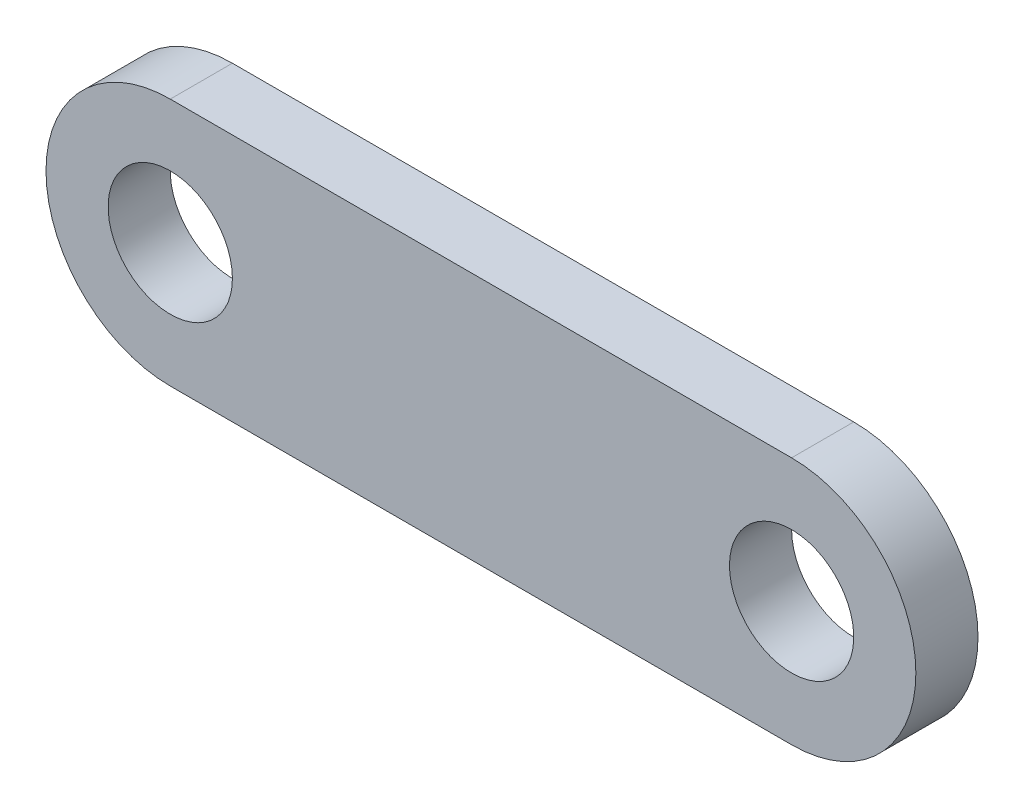
ISO-10303-21;
HEADER;
FILE_DESCRIPTION(('STEP AP214'),'2;1');
FILE_NAME('part.step','',(''),(''),'','','');
FILE_SCHEMA(('AUTOMOTIVE_DESIGN { 1 0 10303 214 1 1 1 1 }'));
ENDSEC;
DATA;
#1=APPLICATION_CONTEXT('core data for automotive mechanical design processes');
#2=APPLICATION_PROTOCOL_DEFINITION('international standard','automotive_design',2000,#1);
#3=PRODUCT_CONTEXT('',#1,'mechanical');
#4=PRODUCT('Part','Part','',(#3));
#5=PRODUCT_RELATED_PRODUCT_CATEGORY('part','',(#4));
#6=PRODUCT_DEFINITION_FORMATION('','',#4);
#7=PRODUCT_DEFINITION_CONTEXT('part definition',#1,'design');
#8=PRODUCT_DEFINITION('design','',#6,#7);
#9=PRODUCT_DEFINITION_SHAPE('','',#8);
#10=(LENGTH_UNIT() NAMED_UNIT(*) SI_UNIT(.MILLI.,.METRE.));
#11=(NAMED_UNIT(*) PLANE_ANGLE_UNIT() SI_UNIT($,.RADIAN.));
#12=(NAMED_UNIT(*) SI_UNIT($,.STERADIAN.) SOLID_ANGLE_UNIT());
#13=UNCERTAINTY_MEASURE_WITH_UNIT(LENGTH_MEASURE(1.E-05),#10,'distance_accuracy_value','');
#14=(GEOMETRIC_REPRESENTATION_CONTEXT(3) GLOBAL_UNCERTAINTY_ASSIGNED_CONTEXT((#13)) GLOBAL_UNIT_ASSIGNED_CONTEXT((#10,
#11,#12)) REPRESENTATION_CONTEXT('',''));
#15=CARTESIAN_POINT('',(0.,0.,0.));
#16=DIRECTION('',(0.,0.,1.));
#17=DIRECTION('',(1.,0.,0.));
#18=AXIS2_PLACEMENT_3D('',#15,#16,#17);
#19=CARTESIAN_POINT('',(0.,0.,2.));
#20=DIRECTION('',(0.,0.,1.));
#21=DIRECTION('',(1.,0.,0.));
#22=AXIS2_PLACEMENT_3D('',#19,#20,#21);
#23=PLANE('',#22);
#24=CARTESIAN_POINT('',(0.,0.,2.));
#25=DIRECTION('',(0.,0.,1.));
#26=DIRECTION('',(1.,0.,0.));
#27=AXIS2_PLACEMENT_3D('',#24,#25,#26);
#28=CIRCLE('',#27,2.);
#29=CARTESIAN_POINT('',(2.,0.,2.));
#30=VERTEX_POINT('',#29);
#31=EDGE_CURVE('E101',#30,#30,#28,.T.);
#32=ORIENTED_EDGE('',*,*,#31,.F.);
#33=EDGE_LOOP('',(#32));
#34=FACE_BOUND('',#33,.T.);
#35=CARTESIAN_POINT('',(0.,0.,2.));
#36=DIRECTION('',(0.,0.,1.));
#37=DIRECTION('',(1.,0.,0.));
#38=AXIS2_PLACEMENT_3D('',#35,#36,#37);
#39=CIRCLE('',#38,4.);
#40=CARTESIAN_POINT('',(0.,4.,2.));
#41=VERTEX_POINT('',#40);
#42=CARTESIAN_POINT('',(0.,-4.,2.));
#43=VERTEX_POINT('',#42);
#44=EDGE_CURVE('E86',#41,#43,#39,.T.);
#45=ORIENTED_EDGE('',*,*,#44,.T.);
#46=DIRECTION('',(1.,0.,0.));
#47=VECTOR('',#46,1.);
#48=CARTESIAN_POINT('',(0.,-4.,2.));
#49=LINE('',#48,#47);
#50=CARTESIAN_POINT('',(20.,-4.,2.));
#51=VERTEX_POINT('',#50);
#52=EDGE_CURVE('E81',#43,#51,#49,.T.);
#53=ORIENTED_EDGE('',*,*,#52,.T.);
#54=CARTESIAN_POINT('',(20.,0.,2.));
#55=DIRECTION('',(0.,0.,1.));
#56=DIRECTION('',(1.,0.,0.));
#57=AXIS2_PLACEMENT_3D('',#54,#55,#56);
#58=CIRCLE('',#57,4.);
#59=CARTESIAN_POINT('',(20.,4.,2.));
#60=VERTEX_POINT('',#59);
#61=EDGE_CURVE('E84',#51,#60,#58,.T.);
#62=ORIENTED_EDGE('',*,*,#61,.T.);
#63=DIRECTION('',(-1.,0.,0.));
#64=VECTOR('',#63,1.);
#65=CARTESIAN_POINT('',(0.,4.,2.));
#66=LINE('',#65,#64);
#67=EDGE_CURVE('E51',#60,#41,#66,.T.);
#68=ORIENTED_EDGE('',*,*,#67,.T.);
#69=EDGE_LOOP('',(#45,#53,#62,#68));
#70=FACE_BOUND('',#69,.T.);
#71=CARTESIAN_POINT('',(20.,0.,2.));
#72=DIRECTION('',(0.,0.,1.));
#73=DIRECTION('',(-1.,0.,0.));
#74=AXIS2_PLACEMENT_3D('',#71,#72,#73);
#75=CIRCLE('',#74,2.);
#76=CARTESIAN_POINT('',(18.,0.,2.));
#77=VERTEX_POINT('',#76);
#78=EDGE_CURVE('E116',#77,#77,#75,.T.);
#79=ORIENTED_EDGE('',*,*,#78,.F.);
#80=EDGE_LOOP('',(#79));
#81=FACE_BOUND('',#80,.T.);
#82=ADVANCED_FACE('F34',(#34,#70,#81),#23,.T.);
#83=CARTESIAN_POINT('',(0.,0.,0.));
#84=DIRECTION('',(0.,0.,1.));
#85=DIRECTION('',(1.,0.,0.));
#86=AXIS2_PLACEMENT_3D('',#83,#84,#85);
#87=PLANE('',#86);
#88=CARTESIAN_POINT('',(0.,0.,0.));
#89=DIRECTION('',(0.,0.,1.));
#90=DIRECTION('',(1.,0.,0.));
#91=AXIS2_PLACEMENT_3D('',#88,#89,#90);
#92=CIRCLE('',#91,4.);
#93=CARTESIAN_POINT('',(0.,4.,0.));
#94=VERTEX_POINT('',#93);
#95=CARTESIAN_POINT('',(0.,-4.,0.));
#96=VERTEX_POINT('',#95);
#97=EDGE_CURVE('E98',#94,#96,#92,.T.);
#98=ORIENTED_EDGE('',*,*,#97,.F.);
#99=DIRECTION('',(-1.,0.,0.));
#100=VECTOR('',#99,1.);
#101=CARTESIAN_POINT('',(0.,4.,0.));
#102=LINE('',#101,#100);
#103=CARTESIAN_POINT('',(20.,4.,0.));
#104=VERTEX_POINT('',#103);
#105=EDGE_CURVE('E74',#104,#94,#102,.T.);
#106=ORIENTED_EDGE('',*,*,#105,.F.);
#107=CARTESIAN_POINT('',(20.,0.,0.));
#108=DIRECTION('',(0.,0.,1.));
#109=DIRECTION('',(1.,0.,0.));
#110=AXIS2_PLACEMENT_3D('',#107,#108,#109);
#111=CIRCLE('',#110,4.);
#112=CARTESIAN_POINT('',(20.,-4.,0.));
#113=VERTEX_POINT('',#112);
#114=EDGE_CURVE('E68',#113,#104,#111,.T.);
#115=ORIENTED_EDGE('',*,*,#114,.F.);
#116=DIRECTION('',(1.,0.,0.));
#117=VECTOR('',#116,1.);
#118=CARTESIAN_POINT('',(0.,-4.,0.));
#119=LINE('',#118,#117);
#120=EDGE_CURVE('E90',#96,#113,#119,.T.);
#121=ORIENTED_EDGE('',*,*,#120,.F.);
#122=EDGE_LOOP('',(#98,#106,#115,#121));
#123=FACE_BOUND('',#122,.T.);
#124=CARTESIAN_POINT('',(0.,0.,0.));
#125=DIRECTION('',(0.,0.,1.));
#126=DIRECTION('',(1.,0.,0.));
#127=AXIS2_PLACEMENT_3D('',#124,#125,#126);
#128=CIRCLE('',#127,2.);
#129=CARTESIAN_POINT('',(2.,0.,0.));
#130=VERTEX_POINT('',#129);
#131=EDGE_CURVE('E113',#130,#130,#128,.T.);
#132=ORIENTED_EDGE('',*,*,#131,.T.);
#133=EDGE_LOOP('',(#132));
#134=FACE_BOUND('',#133,.T.);
#135=CARTESIAN_POINT('',(20.,0.,0.));
#136=DIRECTION('',(0.,0.,1.));
#137=DIRECTION('',(-1.,0.,0.));
#138=AXIS2_PLACEMENT_3D('',#135,#136,#137);
#139=CIRCLE('',#138,2.);
#140=CARTESIAN_POINT('',(18.,0.,0.));
#141=VERTEX_POINT('',#140);
#142=EDGE_CURVE('E119',#141,#141,#139,.T.);
#143=ORIENTED_EDGE('',*,*,#142,.T.);
#144=EDGE_LOOP('',(#143));
#145=FACE_BOUND('',#144,.T.);
#146=ADVANCED_FACE('F109',(#123,#134,#145),#87,.F.);
#147=CARTESIAN_POINT('',(0.,0.,2.));
#148=DIRECTION('',(0.,0.,-1.));
#149=DIRECTION('',(-1.,0.,0.));
#150=AXIS2_PLACEMENT_3D('',#147,#148,#149);
#151=CYLINDRICAL_SURFACE('',#150,4.);
#152=ORIENTED_EDGE('',*,*,#97,.T.);
#153=DIRECTION('',(0.,0.,-1.));
#154=VECTOR('',#153,1.);
#155=CARTESIAN_POINT('',(0.,-4.,2.));
#156=LINE('',#155,#154);
#157=EDGE_CURVE('E11',#43,#96,#156,.T.);
#158=ORIENTED_EDGE('',*,*,#157,.F.);
#159=ORIENTED_EDGE('',*,*,#44,.F.);
#160=DIRECTION('',(0.,0.,-1.));
#161=VECTOR('',#160,1.);
#162=CARTESIAN_POINT('',(0.,4.,2.));
#163=LINE('',#162,#161);
#164=EDGE_CURVE('E94',#41,#94,#163,.T.);
#165=ORIENTED_EDGE('',*,*,#164,.T.);
#166=EDGE_LOOP('',(#152,#158,#159,#165));
#167=FACE_BOUND('',#166,.T.);
#168=ADVANCED_FACE('F36',(#167),#151,.T.);
#169=CARTESIAN_POINT('',(0.,-4.,2.));
#170=DIRECTION('',(0.,1.,0.));
#171=DIRECTION('',(0.,0.,1.));
#172=AXIS2_PLACEMENT_3D('',#169,#170,#171);
#173=PLANE('',#172);
#174=ORIENTED_EDGE('',*,*,#120,.T.);
#175=DIRECTION('',(0.,0.,-1.));
#176=VECTOR('',#175,1.);
#177=CARTESIAN_POINT('',(20.,-4.,2.));
#178=LINE('',#177,#176);
#179=EDGE_CURVE('E43',#51,#113,#178,.T.);
#180=ORIENTED_EDGE('',*,*,#179,.F.);
#181=ORIENTED_EDGE('',*,*,#52,.F.);
#182=ORIENTED_EDGE('',*,*,#157,.T.);
#183=EDGE_LOOP('',(#174,#180,#181,#182));
#184=FACE_BOUND('',#183,.T.);
#185=ADVANCED_FACE('F89',(#184),#173,.F.);
#186=CARTESIAN_POINT('',(20.,0.,2.));
#187=DIRECTION('',(0.,0.,-1.));
#188=DIRECTION('',(-1.,0.,0.));
#189=AXIS2_PLACEMENT_3D('',#186,#187,#188);
#190=CYLINDRICAL_SURFACE('',#189,4.);
#191=ORIENTED_EDGE('',*,*,#114,.T.);
#192=DIRECTION('',(0.,0.,-1.));
#193=VECTOR('',#192,1.);
#194=CARTESIAN_POINT('',(20.,4.,2.));
#195=LINE('',#194,#193);
#196=EDGE_CURVE('E91',#60,#104,#195,.T.);
#197=ORIENTED_EDGE('',*,*,#196,.F.);
#198=ORIENTED_EDGE('',*,*,#61,.F.);
#199=ORIENTED_EDGE('',*,*,#179,.T.);
#200=EDGE_LOOP('',(#191,#197,#198,#199));
#201=FACE_BOUND('',#200,.T.);
#202=ADVANCED_FACE('F92',(#201),#190,.T.);
#203=CARTESIAN_POINT('',(0.,4.,2.));
#204=DIRECTION('',(0.,-1.,0.));
#205=DIRECTION('',(0.,0.,-1.));
#206=AXIS2_PLACEMENT_3D('',#203,#204,#205);
#207=PLANE('',#206);
#208=ORIENTED_EDGE('',*,*,#105,.T.);
#209=ORIENTED_EDGE('',*,*,#164,.F.);
#210=ORIENTED_EDGE('',*,*,#67,.F.);
#211=ORIENTED_EDGE('',*,*,#196,.T.);
#212=EDGE_LOOP('',(#208,#209,#210,#211));
#213=FACE_BOUND('',#212,.T.);
#214=ADVANCED_FACE('F106',(#213),#207,.F.);
#215=CARTESIAN_POINT('',(0.,0.,2.));
#216=DIRECTION('',(0.,0.,-1.));
#217=DIRECTION('',(-1.,0.,0.));
#218=AXIS2_PLACEMENT_3D('',#215,#216,#217);
#219=CYLINDRICAL_SURFACE('',#218,2.);
#220=ORIENTED_EDGE('',*,*,#31,.T.);
#221=EDGE_LOOP('',(#220));
#222=FACE_BOUND('',#221,.T.);
#223=ORIENTED_EDGE('',*,*,#131,.F.);
#224=EDGE_LOOP('',(#223));
#225=FACE_BOUND('',#224,.T.);
#226=ADVANCED_FACE('F136',(#222,#225),#219,.F.);
#227=CARTESIAN_POINT('',(20.,0.,2.));
#228=DIRECTION('',(0.,0.,-1.));
#229=DIRECTION('',(-1.,0.,0.));
#230=AXIS2_PLACEMENT_3D('',#227,#228,#229);
#231=CYLINDRICAL_SURFACE('',#230,2.);
#232=ORIENTED_EDGE('',*,*,#78,.T.);
#233=EDGE_LOOP('',(#232));
#234=FACE_BOUND('',#233,.T.);
#235=ORIENTED_EDGE('',*,*,#142,.F.);
#236=EDGE_LOOP('',(#235));
#237=FACE_BOUND('',#236,.T.);
#238=ADVANCED_FACE('F125',(#234,#237),#231,.F.);
#239=CLOSED_SHELL('',(#82,#146,#168,#185,#202,#214,#226,#238));
#240=MANIFOLD_SOLID_BREP('B2',#239);
#241=ADVANCED_BREP_SHAPE_REPRESENTATION('',(#18,#240),#14);
#242=SHAPE_DEFINITION_REPRESENTATION(#9,#241);
ENDSEC;
END-ISO-10303-21;
